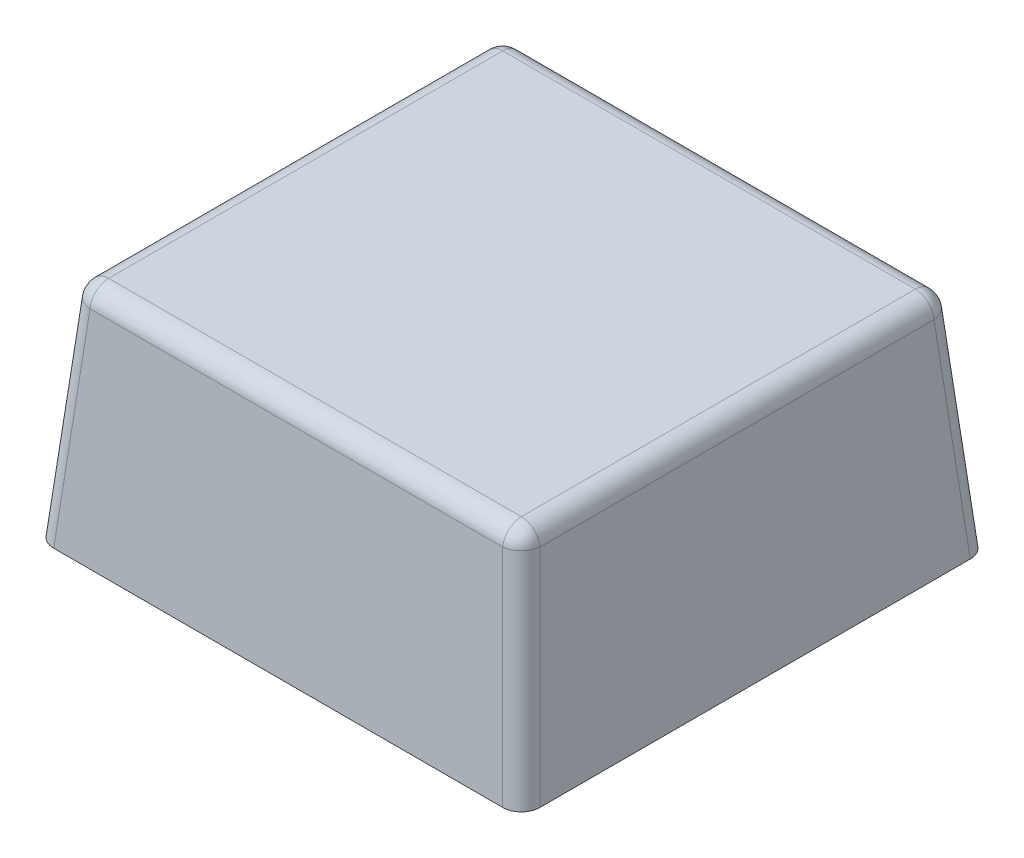
ISO-10303-21;
HEADER;
FILE_DESCRIPTION(('STEP AP214'),'2;1');
FILE_NAME('part.step','',(''),(''),'','','');
FILE_SCHEMA(('AUTOMOTIVE_DESIGN { 1 0 10303 214 1 1 1 1 }'));
ENDSEC;
DATA;
#1=APPLICATION_CONTEXT('core data for automotive mechanical design processes');
#2=APPLICATION_PROTOCOL_DEFINITION('international standard','automotive_design',2000,#1);
#3=PRODUCT_CONTEXT('',#1,'mechanical');
#4=PRODUCT('Part','Part','',(#3));
#5=PRODUCT_RELATED_PRODUCT_CATEGORY('part','',(#4));
#6=PRODUCT_DEFINITION_FORMATION('','',#4);
#7=PRODUCT_DEFINITION_CONTEXT('part definition',#1,'design');
#8=PRODUCT_DEFINITION('design','',#6,#7);
#9=PRODUCT_DEFINITION_SHAPE('','',#8);
#10=(LENGTH_UNIT() NAMED_UNIT(*) SI_UNIT(.MILLI.,.METRE.));
#11=(NAMED_UNIT(*) PLANE_ANGLE_UNIT() SI_UNIT($,.RADIAN.));
#12=(NAMED_UNIT(*) SI_UNIT($,.STERADIAN.) SOLID_ANGLE_UNIT());
#13=UNCERTAINTY_MEASURE_WITH_UNIT(LENGTH_MEASURE(1.E-05),#10,'distance_accuracy_value','');
#14=(GEOMETRIC_REPRESENTATION_CONTEXT(3) GLOBAL_UNCERTAINTY_ASSIGNED_CONTEXT((#13)) GLOBAL_UNIT_ASSIGNED_CONTEXT((#10,
#11,#12)) REPRESENTATION_CONTEXT('',''));
#15=CARTESIAN_POINT('',(0.,0.,0.));
#16=DIRECTION('',(0.,0.,1.));
#17=DIRECTION('',(1.,0.,0.));
#18=AXIS2_PLACEMENT_3D('',#15,#16,#17);
#19=CARTESIAN_POINT('',(0.,0.85,-0.526690243184));
#20=DIRECTION('',(-1.,0.,0.));
#21=DIRECTION('',(0.,0.,1.));
#22=AXIS2_PLACEMENT_3D('',#19,#20,#21);
#23=CYLINDRICAL_SURFACE('',#22,0.05);
#24=CARTESIAN_POINT('',(0.551690243184,0.85,-0.526690243184));
#25=DIRECTION('',(-1.,0.,0.));
#26=DIRECTION('',(0.,0.,-1.));
#27=AXIS2_PLACEMENT_3D('',#24,#25,#26);
#28=CIRCLE('',#27,0.05);
#29=CARTESIAN_POINT('',(0.551690243184,0.9,-0.526690243184));
#30=VERTEX_POINT('',#29);
#31=CARTESIAN_POINT('',(0.551690243184,0.854357787137,-0.576499978088));
#32=VERTEX_POINT('',#31);
#33=EDGE_CURVE('E26',#30,#32,#28,.T.);
#34=ORIENTED_EDGE('',*,*,#33,.T.);
#35=DIRECTION('',(1.,0.,0.));
#36=VECTOR('',#35,1.);
#37=CARTESIAN_POINT('',(0.597506801884,0.854357787137,-0.576499978088));
#38=LINE('',#37,#36);
#39=CARTESIAN_POINT('',(-0.551690243184,0.854357787137,-0.576499978088));
#40=VERTEX_POINT('',#39);
#41=EDGE_CURVE('E170',#40,#32,#38,.T.);
#42=ORIENTED_EDGE('',*,*,#41,.F.);
#43=CARTESIAN_POINT('',(-0.551690243184,0.85,-0.526690243184));
#44=DIRECTION('',(1.,0.,0.));
#45=DIRECTION('',(0.,0.,1.));
#46=AXIS2_PLACEMENT_3D('',#43,#44,#45);
#47=CIRCLE('',#46,0.05);
#48=CARTESIAN_POINT('',(-0.551690243184,0.9,-0.526690243184));
#49=VERTEX_POINT('',#48);
#50=EDGE_CURVE('E11',#40,#49,#47,.T.);
#51=ORIENTED_EDGE('',*,*,#50,.T.);
#52=DIRECTION('',(-1.,0.,0.));
#53=VECTOR('',#52,1.);
#54=CARTESIAN_POINT('',(-0.597506801884,0.9,-0.526690243184));
#55=LINE('',#54,#53);
#56=EDGE_CURVE('E216',#30,#49,#55,.T.);
#57=ORIENTED_EDGE('',*,*,#56,.F.);
#58=EDGE_LOOP('',(#34,#42,#51,#57));
#59=FACE_BOUND('',#58,.T.);
#60=ADVANCED_FACE('F17',(#59),#23,.T.);
#61=CARTESIAN_POINT('',(-0.551690243184,0.85,-0.526690243184));
#62=DIRECTION('',(0.,1.,0.));
#63=DIRECTION('',(1.,0.,0.));
#64=AXIS2_PLACEMENT_3D('',#61,#62,#63);
#65=SPHERICAL_SURFACE('',#64,0.05);
#66=CARTESIAN_POINT('',(-0.551690243184,0.85,-0.526690243184));
#67=DIRECTION('',(0.0868265938642471,0.992432509138969,0.0868265938642274));
#68=DIRECTION('',(0.,-0.0871557427476379,0.996194698091747));
#69=AXIS2_PLACEMENT_3D('',#66,#67,#68);
#70=CIRCLE('',#69,0.05);
#71=CARTESIAN_POINT('',(-0.601499978088,0.854357787137,-0.526690243184));
#72=VERTEX_POINT('',#71);
#73=EDGE_CURVE('E20',#40,#72,#70,.T.);
#74=ORIENTED_EDGE('',*,*,#73,.T.);
#75=CARTESIAN_POINT('',(-0.551690243184,0.85,-0.526690243184));
#76=DIRECTION('',(0.,0.,-1.));
#77=DIRECTION('',(0.,1.,0.));
#78=AXIS2_PLACEMENT_3D('',#75,#76,#77);
#79=CIRCLE('',#78,0.05);
#80=EDGE_CURVE('E155',#72,#49,#79,.T.);
#81=ORIENTED_EDGE('',*,*,#80,.T.);
#82=ORIENTED_EDGE('',*,*,#50,.F.);
#83=EDGE_LOOP('',(#74,#81,#82));
#84=FACE_BOUND('',#83,.T.);
#85=ADVANCED_FACE('F572',(#84),#65,.T.);
#86=CARTESIAN_POINT('',(0.551690243184,0.85,-0.526690243184));
#87=DIRECTION('',(0.,1.,0.));
#88=DIRECTION('',(1.,0.,0.));
#89=AXIS2_PLACEMENT_3D('',#86,#87,#88);
#90=SPHERICAL_SURFACE('',#89,0.05);
#91=CARTESIAN_POINT('',(0.551690243184,0.85,-0.526690243184));
#92=DIRECTION('',(0.,0.,-1.));
#93=DIRECTION('',(-1.,0.,0.));
#94=AXIS2_PLACEMENT_3D('',#91,#92,#93);
#95=CIRCLE('',#94,0.05);
#96=CARTESIAN_POINT('',(0.601499978088,0.854357787137,-0.526690243184));
#97=VERTEX_POINT('',#96);
#98=EDGE_CURVE('E266',#30,#97,#95,.T.);
#99=ORIENTED_EDGE('',*,*,#98,.T.);
#100=CARTESIAN_POINT('',(0.551690243184,0.85,-0.526690243184));
#101=DIRECTION('',(-0.0868265938642471,0.992432509138969,0.0868265938642274));
#102=DIRECTION('',(0.,-0.0871557427476379,0.996194698091747));
#103=AXIS2_PLACEMENT_3D('',#100,#101,#102);
#104=CIRCLE('',#103,0.05);
#105=EDGE_CURVE('E127',#97,#32,#104,.T.);
#106=ORIENTED_EDGE('',*,*,#105,.T.);
#107=ORIENTED_EDGE('',*,*,#33,.F.);
#108=EDGE_LOOP('',(#99,#106,#107));
#109=FACE_BOUND('',#108,.T.);
#110=ADVANCED_FACE('F283',(#109),#90,.T.);
#111=CARTESIAN_POINT('',(-0.591142201832,0.399062049208,-0.566142201832));
#112=DIRECTION('',(-0.0868265938642274,-0.992432509138969,-0.0868265938642471));
#113=DIRECTION('',(0.996194698091747,-0.0871557427476379,0.));
#114=AXIS2_PLACEMENT_3D('',#111,#112,#113);
#115=CYLINDRICAL_SURFACE('',#114,0.05);
#116=CARTESIAN_POINT('',(-0.65,0.3,-0.575190265095));
#117=CARTESIAN_POINT('',(-0.65,0.3,-0.604413846781));
#118=CARTESIAN_POINT('',(-0.629413846781,0.3,-0.625));
#119=CARTESIAN_POINT('',(-0.600190265095,0.3,-0.625));
#120=(BOUNDED_CURVE() B_SPLINE_CURVE(3,(#116,#117,#118,#119),.UNSPECIFIED.,.F.,
.F.) B_SPLINE_CURVE_WITH_KNOTS((4,4),(5.501585242055,7.064785372304),
.UNSPECIFIED.) CURVE() GEOMETRIC_REPRESENTATION_ITEM() RATIONAL_B_SPLINE_CURVE((1.,
0.806524890385,0.806524890385,1.)) REPRESENTATION_ITEM(''));
#121=CARTESIAN_POINT('',(-0.65,0.3,-0.575190265095));
#122=VERTEX_POINT('',#121);
#123=CARTESIAN_POINT('',(-0.600190265095,0.3,-0.625));
#124=VERTEX_POINT('',#123);
#125=EDGE_CURVE('E228',#122,#124,#120,.T.);
#126=ORIENTED_EDGE('',*,*,#125,.F.);
#127=DIRECTION('',(-0.0868265938642471,-0.992432509138967,-0.0868265938642471));
#128=VECTOR('',#127,1.);
#129=CARTESIAN_POINT('',(-0.640951936736,0.403419836345,-0.566142201832));
#130=LINE('',#129,#128);
#131=EDGE_CURVE('E158',#72,#122,#130,.T.);
#132=ORIENTED_EDGE('',*,*,#131,.F.);
#133=ORIENTED_EDGE('',*,*,#73,.F.);
#134=DIRECTION('',(0.0868265938642471,0.992432509138967,0.0868265938642471));
#135=VECTOR('',#134,1.);
#136=CARTESIAN_POINT('',(-0.590765258961,0.407728313066,-0.615574993866));
#137=LINE('',#136,#135);
#138=EDGE_CURVE('E175',#124,#40,#137,.T.);
#139=ORIENTED_EDGE('',*,*,#138,.F.);
#140=EDGE_LOOP('',(#126,#132,#133,#139));
#141=FACE_BOUND('',#140,.T.);
#142=ADVANCED_FACE('F319',(#141),#115,.T.);
#143=CARTESIAN_POINT('',(-0.551690243184,0.85,0.));
#144=DIRECTION('',(0.,0.,1.));
#145=DIRECTION('',(1.,0.,0.));
#146=AXIS2_PLACEMENT_3D('',#143,#144,#145);
#147=CYLINDRICAL_SURFACE('',#146,0.05);
#148=CARTESIAN_POINT('',(-0.551690243184,0.85,0.526690243184));
#149=DIRECTION('',(0.,0.,-1.));
#150=DIRECTION('',(1.,0.,0.));
#151=AXIS2_PLACEMENT_3D('',#148,#149,#150);
#152=CIRCLE('',#151,0.05);
#153=CARTESIAN_POINT('',(-0.601499978088,0.854357787137,0.526690243184));
#154=VERTEX_POINT('',#153);
#155=CARTESIAN_POINT('',(-0.551690243184,0.9,0.526690243184));
#156=VERTEX_POINT('',#155);
#157=EDGE_CURVE('E39',#154,#156,#152,.T.);
#158=ORIENTED_EDGE('',*,*,#157,.T.);
#159=DIRECTION('',(0.,0.,1.));
#160=VECTOR('',#159,1.);
#161=CARTESIAN_POINT('',(-0.551690243184,0.9,0.572506801884));
#162=LINE('',#161,#160);
#163=EDGE_CURVE('E220',#49,#156,#162,.T.);
#164=ORIENTED_EDGE('',*,*,#163,.F.);
#165=ORIENTED_EDGE('',*,*,#80,.F.);
#166=DIRECTION('',(0.,0.,-1.));
#167=VECTOR('',#166,1.);
#168=CARTESIAN_POINT('',(-0.601499978088,0.854357787137,-0.572506801884));
#169=LINE('',#168,#167);
#170=EDGE_CURVE('E147',#154,#72,#169,.T.);
#171=ORIENTED_EDGE('',*,*,#170,.F.);
#172=EDGE_LOOP('',(#158,#164,#165,#171));
#173=FACE_BOUND('',#172,.T.);
#174=ADVANCED_FACE('F154',(#173),#147,.T.);
#175=CARTESIAN_POINT('',(0.551690243184,0.85,0.));
#176=DIRECTION('',(0.,0.,-1.));
#177=DIRECTION('',(-1.,0.,0.));
#178=AXIS2_PLACEMENT_3D('',#175,#176,#177);
#179=CYLINDRICAL_SURFACE('',#178,0.05);
#180=CARTESIAN_POINT('',(0.551690243184,0.85,0.526690243184));
#181=DIRECTION('',(0.,0.,-1.));
#182=DIRECTION('',(0.,-1.,0.));
#183=AXIS2_PLACEMENT_3D('',#180,#181,#182);
#184=CIRCLE('',#183,0.05);
#185=CARTESIAN_POINT('',(0.551690243184,0.9,0.526690243184));
#186=VERTEX_POINT('',#185);
#187=CARTESIAN_POINT('',(0.601499978088,0.854357787137,0.526690243184));
#188=VERTEX_POINT('',#187);
#189=EDGE_CURVE('E128',#186,#188,#184,.T.);
#190=ORIENTED_EDGE('',*,*,#189,.T.);
#191=DIRECTION('',(0.,0.,1.));
#192=VECTOR('',#191,1.);
#193=CARTESIAN_POINT('',(0.601499978088,0.854357787137,0.572506801884));
#194=LINE('',#193,#192);
#195=EDGE_CURVE('E176',#97,#188,#194,.T.);
#196=ORIENTED_EDGE('',*,*,#195,.F.);
#197=ORIENTED_EDGE('',*,*,#98,.F.);
#198=DIRECTION('',(0.,0.,-1.));
#199=VECTOR('',#198,1.);
#200=CARTESIAN_POINT('',(0.551690243184,0.9,-0.572506801884));
#201=LINE('',#200,#199);
#202=EDGE_CURVE('E192',#186,#30,#201,.T.);
#203=ORIENTED_EDGE('',*,*,#202,.F.);
#204=EDGE_LOOP('',(#190,#196,#197,#203));
#205=FACE_BOUND('',#204,.T.);
#206=ADVANCED_FACE('F291',(#205),#179,.T.);
#207=CARTESIAN_POINT('',(0.600565773584,0.291350131197,-0.575565773584));
#208=DIRECTION('',(0.0868265938642471,-0.992432509138969,-0.0868265938642274));
#209=DIRECTION('',(0.,0.0871557427476379,-0.996194698091747));
#210=AXIS2_PLACEMENT_3D('',#207,#208,#209);
#211=CYLINDRICAL_SURFACE('',#210,0.05);
#212=CARTESIAN_POINT('',(0.600190265095,0.3,-0.625));
#213=CARTESIAN_POINT('',(0.629413846781,0.3,-0.625));
#214=CARTESIAN_POINT('',(0.65,0.3,-0.604413846781));
#215=CARTESIAN_POINT('',(0.65,0.3,-0.575190265095));
#216=(BOUNDED_CURVE() B_SPLINE_CURVE(3,(#212,#213,#214,#215),.UNSPECIFIED.,.F.,
.F.) B_SPLINE_CURVE_WITH_KNOTS((4,4),(5.501585242055,7.064785372304),
.UNSPECIFIED.) CURVE() GEOMETRIC_REPRESENTATION_ITEM() RATIONAL_B_SPLINE_CURVE((1.,
0.806524890385,0.806524890385,1.)) REPRESENTATION_ITEM(''));
#217=CARTESIAN_POINT('',(0.600190265095,0.3,-0.625));
#218=VERTEX_POINT('',#217);
#219=CARTESIAN_POINT('',(0.65,0.3,-0.575190265095));
#220=VERTEX_POINT('',#219);
#221=EDGE_CURVE('E233',#218,#220,#216,.T.);
#222=ORIENTED_EDGE('',*,*,#221,.F.);
#223=DIRECTION('',(0.0868265938642471,-0.992432509138967,-0.0868265938642471));
#224=VECTOR('',#223,1.);
#225=CARTESIAN_POINT('',(0.600565773584,0.295707918334,-0.625375508489));
#226=LINE('',#225,#224);
#227=EDGE_CURVE('E174',#32,#218,#226,.T.);
#228=ORIENTED_EDGE('',*,*,#227,.F.);
#229=ORIENTED_EDGE('',*,*,#105,.F.);
#230=DIRECTION('',(-0.0868265938642471,0.992432509138967,0.0868265938642471));
#231=VECTOR('',#230,1.);
#232=CARTESIAN_POINT('',(0.640951936736,0.403419836345,-0.566142201832));
#233=LINE('',#232,#231);
#234=EDGE_CURVE('E181',#220,#97,#233,.T.);
#235=ORIENTED_EDGE('',*,*,#234,.F.);
#236=EDGE_LOOP('',(#222,#228,#229,#235));
#237=FACE_BOUND('',#236,.T.);
#238=ADVANCED_FACE('F290',(#237),#211,.T.);
#239=CARTESIAN_POINT('',(-0.551690243184,0.85,0.526690243184));
#240=DIRECTION('',(0.,1.,0.));
#241=DIRECTION('',(1.,0.,0.));
#242=AXIS2_PLACEMENT_3D('',#239,#240,#241);
#243=SPHERICAL_SURFACE('',#242,0.05);
#244=CARTESIAN_POINT('',(-0.551690243184,0.85,0.526690243184));
#245=DIRECTION('',(0.0868265938642471,0.992432509138969,-0.0868265938642274));
#246=DIRECTION('',(0.,0.0871557427476379,0.996194698091747));
#247=AXIS2_PLACEMENT_3D('',#244,#245,#246);
#248=CIRCLE('',#247,0.05);
#249=CARTESIAN_POINT('',(-0.551690243184,0.854357787137,0.576499978088));
#250=VERTEX_POINT('',#249);
#251=EDGE_CURVE('E122',#154,#250,#248,.T.);
#252=ORIENTED_EDGE('',*,*,#251,.T.);
#253=CARTESIAN_POINT('',(-0.551690243184,0.85,0.526690243184));
#254=DIRECTION('',(-1.,0.,0.));
#255=DIRECTION('',(0.,0.,1.));
#256=AXIS2_PLACEMENT_3D('',#253,#254,#255);
#257=CIRCLE('',#256,0.05);
#258=EDGE_CURVE('E124',#250,#156,#257,.T.);
#259=ORIENTED_EDGE('',*,*,#258,.T.);
#260=ORIENTED_EDGE('',*,*,#157,.F.);
#261=EDGE_LOOP('',(#252,#259,#260));
#262=FACE_BOUND('',#261,.T.);
#263=ADVANCED_FACE('F121',(#262),#243,.T.);
#264=CARTESIAN_POINT('',(0.551690243184,0.85,0.526690243184));
#265=DIRECTION('',(0.,1.,0.));
#266=DIRECTION('',(1.,0.,0.));
#267=AXIS2_PLACEMENT_3D('',#264,#265,#266);
#268=SPHERICAL_SURFACE('',#267,0.05);
#269=CARTESIAN_POINT('',(0.551690243184,0.85,0.526690243184));
#270=DIRECTION('',(1.,0.,0.));
#271=DIRECTION('',(0.,0.,-1.));
#272=AXIS2_PLACEMENT_3D('',#269,#270,#271);
#273=CIRCLE('',#272,0.05);
#274=CARTESIAN_POINT('',(0.551690243184,0.854357787137,0.576499978088));
#275=VERTEX_POINT('',#274);
#276=EDGE_CURVE('E141',#186,#275,#273,.T.);
#277=ORIENTED_EDGE('',*,*,#276,.T.);
#278=CARTESIAN_POINT('',(0.551690243184,0.85,0.526690243184));
#279=DIRECTION('',(-0.0868265938642471,0.992432509138969,-0.0868265938642274));
#280=DIRECTION('',(0.,0.0871557427476379,0.996194698091747));
#281=AXIS2_PLACEMENT_3D('',#278,#279,#280);
#282=CIRCLE('',#281,0.05);
#283=EDGE_CURVE('E257',#275,#188,#282,.T.);
#284=ORIENTED_EDGE('',*,*,#283,.T.);
#285=ORIENTED_EDGE('',*,*,#189,.F.);
#286=EDGE_LOOP('',(#277,#284,#285));
#287=FACE_BOUND('',#286,.T.);
#288=ADVANCED_FACE('F312',(#287),#268,.T.);
#289=CARTESIAN_POINT('',(-0.590765258961,0.403370525928,0.565765258961));
#290=DIRECTION('',(-0.0868265938642471,-0.992432509138969,0.0868265938642274));
#291=DIRECTION('',(0.,-0.0871557427476379,-0.996194698091747));
#292=AXIS2_PLACEMENT_3D('',#289,#290,#291);
#293=CYLINDRICAL_SURFACE('',#292,0.05);
#294=CARTESIAN_POINT('',(-0.600190265095,0.3,0.625));
#295=CARTESIAN_POINT('',(-0.629413846781,0.3,0.625));
#296=CARTESIAN_POINT('',(-0.65,0.3,0.604413846781));
#297=CARTESIAN_POINT('',(-0.65,0.3,0.575190265095));
#298=(BOUNDED_CURVE() B_SPLINE_CURVE(3,(#294,#295,#296,#297),.UNSPECIFIED.,.F.,
.F.) B_SPLINE_CURVE_WITH_KNOTS((4,4),(5.501585242055,7.064785372304),
.UNSPECIFIED.) CURVE() GEOMETRIC_REPRESENTATION_ITEM() RATIONAL_B_SPLINE_CURVE((1.,
0.806524890385,0.806524890385,1.)) REPRESENTATION_ITEM(''));
#299=CARTESIAN_POINT('',(-0.600190265095,0.3,0.625));
#300=VERTEX_POINT('',#299);
#301=CARTESIAN_POINT('',(-0.65,0.3,0.575190265095));
#302=VERTEX_POINT('',#301);
#303=EDGE_CURVE('E249',#300,#302,#298,.T.);
#304=ORIENTED_EDGE('',*,*,#303,.F.);
#305=DIRECTION('',(-0.0868265938642471,-0.992432509138967,0.0868265938642471));
#306=VECTOR('',#305,1.);
#307=CARTESIAN_POINT('',(-0.590765258961,0.407728313066,0.615574993866));
#308=LINE('',#307,#306);
#309=EDGE_CURVE('E138',#250,#300,#308,.T.);
#310=ORIENTED_EDGE('',*,*,#309,.F.);
#311=ORIENTED_EDGE('',*,*,#251,.F.);
#312=DIRECTION('',(0.0868265938642471,0.992432509138967,-0.0868265938642471));
#313=VECTOR('',#312,1.);
#314=CARTESIAN_POINT('',(-0.650375508489,0.295707918334,0.575565773584));
#315=LINE('',#314,#313);
#316=EDGE_CURVE('E135',#302,#154,#315,.T.);
#317=ORIENTED_EDGE('',*,*,#316,.F.);
#318=EDGE_LOOP('',(#304,#310,#311,#317));
#319=FACE_BOUND('',#318,.T.);
#320=ADVANCED_FACE('F134',(#319),#293,.T.);
#321=CARTESIAN_POINT('',(0.,0.85,0.526690243184));
#322=DIRECTION('',(1.,0.,0.));
#323=DIRECTION('',(0.,0.,-1.));
#324=AXIS2_PLACEMENT_3D('',#321,#322,#323);
#325=CYLINDRICAL_SURFACE('',#324,0.05);
#326=ORIENTED_EDGE('',*,*,#258,.F.);
#327=DIRECTION('',(-1.,0.,0.));
#328=VECTOR('',#327,1.);
#329=CARTESIAN_POINT('',(-0.597506801884,0.854357787137,0.576499978088));
#330=LINE('',#329,#328);
#331=EDGE_CURVE('E151',#275,#250,#330,.T.);
#332=ORIENTED_EDGE('',*,*,#331,.F.);
#333=ORIENTED_EDGE('',*,*,#276,.F.);
#334=DIRECTION('',(1.,0.,0.));
#335=VECTOR('',#334,1.);
#336=CARTESIAN_POINT('',(0.597506801884,0.9,0.526690243184));
#337=LINE('',#336,#335);
#338=EDGE_CURVE('E224',#156,#186,#337,.T.);
#339=ORIENTED_EDGE('',*,*,#338,.F.);
#340=EDGE_LOOP('',(#326,#332,#333,#339));
#341=FACE_BOUND('',#340,.T.);
#342=ADVANCED_FACE('F308',(#341),#325,.T.);
#343=CARTESIAN_POINT('',(0.600565773584,0.291350131197,0.575565773584));
#344=DIRECTION('',(0.0868265938642274,-0.992432509138969,0.0868265938642471));
#345=DIRECTION('',(0.996194698091747,0.0871557427476379,0.));
#346=AXIS2_PLACEMENT_3D('',#343,#344,#345);
#347=CYLINDRICAL_SURFACE('',#346,0.05);
#348=CARTESIAN_POINT('',(0.65,0.3,0.575190265095));
#349=CARTESIAN_POINT('',(0.65,0.3,0.604413846781));
#350=CARTESIAN_POINT('',(0.629413846781,0.3,0.625));
#351=CARTESIAN_POINT('',(0.600190265095,0.3,0.625));
#352=(BOUNDED_CURVE() B_SPLINE_CURVE(3,(#348,#349,#350,#351),.UNSPECIFIED.,.F.,
.F.) B_SPLINE_CURVE_WITH_KNOTS((4,4),(5.501585242055,7.064785372304),
.UNSPECIFIED.) CURVE() GEOMETRIC_REPRESENTATION_ITEM() RATIONAL_B_SPLINE_CURVE((1.,
0.806524890385,0.806524890385,1.)) REPRESENTATION_ITEM(''));
#353=CARTESIAN_POINT('',(0.65,0.3,0.575190265095));
#354=VERTEX_POINT('',#353);
#355=CARTESIAN_POINT('',(0.600190265095,0.3,0.625));
#356=VERTEX_POINT('',#355);
#357=EDGE_CURVE('E241',#354,#356,#352,.T.);
#358=ORIENTED_EDGE('',*,*,#357,.F.);
#359=DIRECTION('',(0.0868265938642471,-0.992432509138967,0.0868265938642471));
#360=VECTOR('',#359,1.);
#361=CARTESIAN_POINT('',(0.650375508489,0.295707918334,0.575565773584));
#362=LINE('',#361,#360);
#363=EDGE_CURVE('E180',#188,#354,#362,.T.);
#364=ORIENTED_EDGE('',*,*,#363,.F.);
#365=ORIENTED_EDGE('',*,*,#283,.F.);
#366=DIRECTION('',(-0.0868265938642471,0.992432509138967,-0.0868265938642471));
#367=VECTOR('',#366,1.);
#368=CARTESIAN_POINT('',(0.600565773584,0.295707918334,0.625375508489));
#369=LINE('',#368,#367);
#370=EDGE_CURVE('E188',#356,#275,#369,.T.);
#371=ORIENTED_EDGE('',*,*,#370,.F.);
#372=EDGE_LOOP('',(#358,#364,#365,#371));
#373=FACE_BOUND('',#372,.T.);
#374=ADVANCED_FACE('F314',(#373),#347,.T.);
#375=CARTESIAN_POINT('',(0.,0.3,0.));
#376=DIRECTION('',(0.,1.,0.));
#377=DIRECTION('',(1.,0.,0.));
#378=AXIS2_PLACEMENT_3D('',#375,#376,#377);
#379=PLANE('',#378);
#380=DIRECTION('',(0.,0.,1.));
#381=VECTOR('',#380,1.);
#382=CARTESIAN_POINT('',(-0.65,0.3,0.625));
#383=LINE('',#382,#381);
#384=EDGE_CURVE('E149',#122,#302,#383,.T.);
#385=ORIENTED_EDGE('',*,*,#384,.F.);
#386=ORIENTED_EDGE('',*,*,#125,.T.);
#387=DIRECTION('',(-1.,0.,0.));
#388=VECTOR('',#387,1.);
#389=CARTESIAN_POINT('',(0.65,0.3,-0.625));
#390=LINE('',#389,#388);
#391=EDGE_CURVE('E199',#218,#124,#390,.T.);
#392=ORIENTED_EDGE('',*,*,#391,.F.);
#393=ORIENTED_EDGE('',*,*,#221,.T.);
#394=DIRECTION('',(0.,0.,-1.));
#395=VECTOR('',#394,1.);
#396=CARTESIAN_POINT('',(0.65,0.3,0.625));
#397=LINE('',#396,#395);
#398=EDGE_CURVE('E196',#354,#220,#397,.T.);
#399=ORIENTED_EDGE('',*,*,#398,.F.);
#400=ORIENTED_EDGE('',*,*,#357,.T.);
#401=DIRECTION('',(1.,0.,0.));
#402=VECTOR('',#401,1.);
#403=CARTESIAN_POINT('',(0.65,0.3,0.625));
#404=LINE('',#403,#402);
#405=EDGE_CURVE('E184',#300,#356,#404,.T.);
#406=ORIENTED_EDGE('',*,*,#405,.F.);
#407=ORIENTED_EDGE('',*,*,#303,.T.);
#408=EDGE_LOOP('',(#385,#386,#392,#393,#399,#400,#406,#407));
#409=FACE_BOUND('',#408,.T.);
#410=ADVANCED_FACE('F297',(#409),#379,.F.);
#411=CARTESIAN_POINT('',(0.,0.9,0.));
#412=DIRECTION('',(0.,1.,0.));
#413=DIRECTION('',(1.,0.,0.));
#414=AXIS2_PLACEMENT_3D('',#411,#412,#413);
#415=PLANE('',#414);
#416=ORIENTED_EDGE('',*,*,#202,.T.);
#417=ORIENTED_EDGE('',*,*,#56,.T.);
#418=ORIENTED_EDGE('',*,*,#163,.T.);
#419=ORIENTED_EDGE('',*,*,#338,.T.);
#420=EDGE_LOOP('',(#416,#417,#418,#419));
#421=FACE_BOUND('',#420,.T.);
#422=ADVANCED_FACE('F305',(#421),#415,.T.);
#423=CARTESIAN_POINT('',(0.65,0.3,-0.625));
#424=DIRECTION('',(0.,0.0871557427476379,-0.996194698091747));
#425=DIRECTION('',(-1.,0.,0.));
#426=AXIS2_PLACEMENT_3D('',#423,#424,#425);
#427=PLANE('',#426);
#428=ORIENTED_EDGE('',*,*,#391,.T.);
#429=ORIENTED_EDGE('',*,*,#138,.T.);
#430=ORIENTED_EDGE('',*,*,#41,.T.);
#431=ORIENTED_EDGE('',*,*,#227,.T.);
#432=EDGE_LOOP('',(#428,#429,#430,#431));
#433=FACE_BOUND('',#432,.T.);
#434=ADVANCED_FACE('F302',(#433),#427,.T.);
#435=CARTESIAN_POINT('',(0.65,0.3,0.625));
#436=DIRECTION('',(0.996194698091747,0.0871557427476379,0.));
#437=DIRECTION('',(0.,0.,-1.));
#438=AXIS2_PLACEMENT_3D('',#435,#436,#437);
#439=PLANE('',#438);
#440=ORIENTED_EDGE('',*,*,#398,.T.);
#441=ORIENTED_EDGE('',*,*,#234,.T.);
#442=ORIENTED_EDGE('',*,*,#195,.T.);
#443=ORIENTED_EDGE('',*,*,#363,.T.);
#444=EDGE_LOOP('',(#440,#441,#442,#443));
#445=FACE_BOUND('',#444,.T.);
#446=ADVANCED_FACE('F293',(#445),#439,.T.);
#447=CARTESIAN_POINT('',(0.65,0.3,0.625));
#448=DIRECTION('',(0.,0.0871557427476379,0.996194698091747));
#449=DIRECTION('',(1.,0.,0.));
#450=AXIS2_PLACEMENT_3D('',#447,#448,#449);
#451=PLANE('',#450);
#452=ORIENTED_EDGE('',*,*,#331,.T.);
#453=ORIENTED_EDGE('',*,*,#309,.T.);
#454=ORIENTED_EDGE('',*,*,#405,.T.);
#455=ORIENTED_EDGE('',*,*,#370,.T.);
#456=EDGE_LOOP('',(#452,#453,#454,#455));
#457=FACE_BOUND('',#456,.T.);
#458=ADVANCED_FACE('F316',(#457),#451,.T.);
#459=CARTESIAN_POINT('',(-0.65,0.3,0.625));
#460=DIRECTION('',(-0.996194698091747,0.0871557427476379,0.));
#461=DIRECTION('',(0.,0.,1.));
#462=AXIS2_PLACEMENT_3D('',#459,#460,#461);
#463=PLANE('',#462);
#464=ORIENTED_EDGE('',*,*,#170,.T.);
#465=ORIENTED_EDGE('',*,*,#131,.T.);
#466=ORIENTED_EDGE('',*,*,#384,.T.);
#467=ORIENTED_EDGE('',*,*,#316,.T.);
#468=EDGE_LOOP('',(#464,#465,#466,#467));
#469=FACE_BOUND('',#468,.T.);
#470=ADVANCED_FACE('F145',(#469),#463,.T.);
#471=CLOSED_SHELL('',(#60,#85,#110,#142,#174,#206,#238,#263,#288,#320,#342,#374,#410,#422,#434,
#446,#458,#470));
#472=MANIFOLD_SOLID_BREP('B1',#471);
#473=ADVANCED_BREP_SHAPE_REPRESENTATION('',(#18,#472),#14);
#474=SHAPE_DEFINITION_REPRESENTATION(#9,#473);
ENDSEC;
END-ISO-10303-21;
